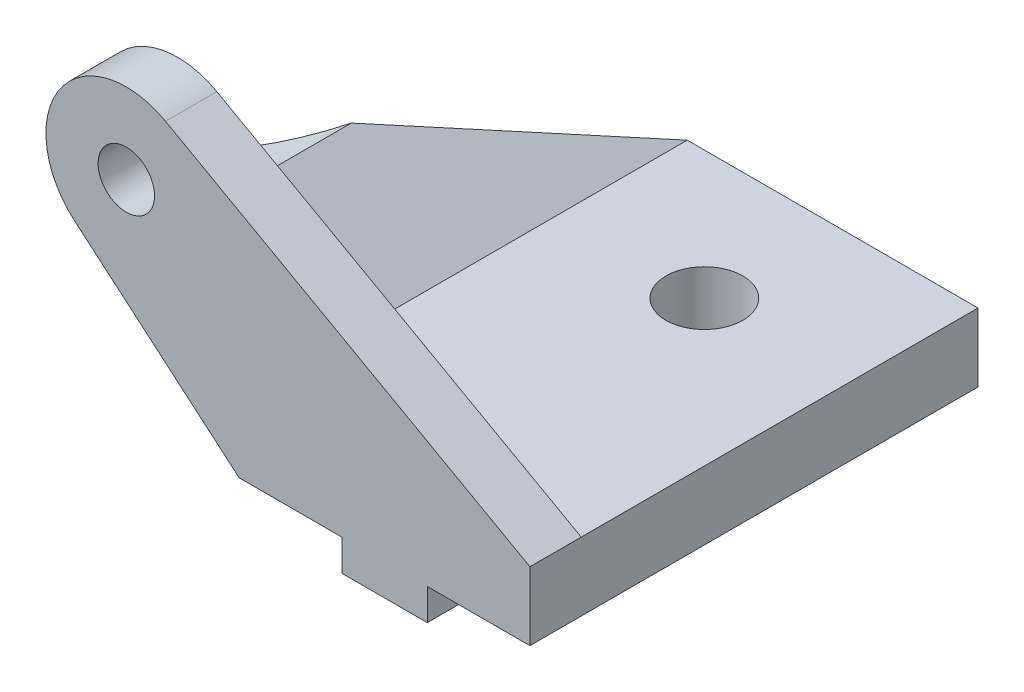
ISO-10303-21;
HEADER;
FILE_DESCRIPTION(('STEP AP214'),'2;1');
FILE_NAME('part.step','',(''),(''),'','','');
FILE_SCHEMA(('AUTOMOTIVE_DESIGN { 1 0 10303 214 1 1 1 1 }'));
ENDSEC;
DATA;
#1=APPLICATION_CONTEXT('core data for automotive mechanical design processes');
#2=APPLICATION_PROTOCOL_DEFINITION('international standard','automotive_design',2000,#1);
#3=PRODUCT_CONTEXT('',#1,'mechanical');
#4=PRODUCT('Part','Part','',(#3));
#5=PRODUCT_RELATED_PRODUCT_CATEGORY('part','',(#4));
#6=PRODUCT_DEFINITION_FORMATION('','',#4);
#7=PRODUCT_DEFINITION_CONTEXT('part definition',#1,'design');
#8=PRODUCT_DEFINITION('design','',#6,#7);
#9=PRODUCT_DEFINITION_SHAPE('','',#8);
#10=(LENGTH_UNIT() NAMED_UNIT(*) SI_UNIT(.MILLI.,.METRE.));
#11=(NAMED_UNIT(*) PLANE_ANGLE_UNIT() SI_UNIT($,.RADIAN.));
#12=(NAMED_UNIT(*) SI_UNIT($,.STERADIAN.) SOLID_ANGLE_UNIT());
#13=UNCERTAINTY_MEASURE_WITH_UNIT(LENGTH_MEASURE(1.E-05),#10,'distance_accuracy_value','');
#14=(GEOMETRIC_REPRESENTATION_CONTEXT(3) GLOBAL_UNCERTAINTY_ASSIGNED_CONTEXT((#13)) GLOBAL_UNIT_ASSIGNED_CONTEXT((#10,
#11,#12)) REPRESENTATION_CONTEXT('',''));
#15=CARTESIAN_POINT('',(0.,0.,0.));
#16=DIRECTION('',(0.,0.,1.));
#17=DIRECTION('',(1.,0.,0.));
#18=AXIS2_PLACEMENT_3D('',#15,#16,#17);
#19=CARTESIAN_POINT('',(57.4545476760808,46.6673616439568,-3.));
#20=DIRECTION('',(-0.9233322774381,0.,-0.384001960204596));
#21=DIRECTION('',(-0.384001960204596,0.,0.9233322774381));
#22=AXIS2_PLACEMENT_3D('',#19,#20,#21);
#23=PLANE('',#22);
#24=DIRECTION('',(0.364955870497366,-0.311027045111073,-0.877535976355946));
#25=VECTOR('',#24,1.);
#26=CARTESIAN_POINT('',(57.4545476760808,46.6673616439568,-3.));
#27=LINE('',#26,#25);
#28=CARTESIAN_POINT('',(57.4545476760808,46.6673616439568,-3.));
#29=VERTEX_POINT('',#28);
#30=CARTESIAN_POINT('',(57.5251306932339,46.6072085431716,-3.16971678462709));
#31=VERTEX_POINT('',#30);
#32=EDGE_CURVE('E147',#29,#31,#27,.T.);
#33=ORIENTED_EDGE('',*,*,#32,.T.);
#34=CARTESIAN_POINT('',(60.5031278182863,46.2445335879022,-10.3303074915436));
#35=DIRECTION('',(-0.9233322774381,0.,-0.384001960204596));
#36=DIRECTION('',(-0.384001960204596,0.,0.9233322774381));
#37=AXIS2_PLACEMENT_3D('',#34,#35,#36);
#38=ELLIPSE('',#37,7.81246011973899,3.);
#39=CARTESIAN_POINT('',(61.3333699476798,43.3617054614645,-12.326623749277));
#40=VERTEX_POINT('',#39);
#41=EDGE_CURVE('E131',#31,#40,#38,.F.);
#42=ORIENTED_EDGE('',*,*,#41,.T.);
#43=CARTESIAN_POINT('',(67.1031278182863,38.4445335879022,-26.2));
#44=VERTEX_POINT('',#43);
#45=EDGE_CURVE('E139',#40,#44,#27,.T.);
#46=ORIENTED_EDGE('',*,*,#45,.T.);
#47=DIRECTION('',(0.,-1.,0.));
#48=VECTOR('',#47,1.);
#49=CARTESIAN_POINT('',(67.1031278182863,38.4445335879022,-26.2));
#50=LINE('',#49,#48);
#51=CARTESIAN_POINT('',(67.1031278182863,34.4445335879022,-26.2));
#52=VERTEX_POINT('',#51);
#53=EDGE_CURVE('E186',#44,#52,#50,.T.);
#54=ORIENTED_EDGE('',*,*,#53,.T.);
#55=DIRECTION('',(0.364955870497366,-0.311027045111073,-0.877535976355946));
#56=VECTOR('',#55,1.);
#57=CARTESIAN_POINT('',(57.4545476760808,42.6673616439568,-3.));
#58=LINE('',#57,#56);
#59=CARTESIAN_POINT('',(57.4545476760808,42.6673616439568,-3.));
#60=VERTEX_POINT('',#59);
#61=EDGE_CURVE('E149',#60,#52,#58,.T.);
#62=ORIENTED_EDGE('',*,*,#61,.F.);
#63=DIRECTION('',(0.,-1.,0.));
#64=VECTOR('',#63,1.);
#65=CARTESIAN_POINT('',(57.4545476760808,46.6673616439568,-3.));
#66=LINE('',#65,#64);
#67=EDGE_CURVE('E155',#29,#60,#66,.T.);
#68=ORIENTED_EDGE('',*,*,#67,.F.);
#69=EDGE_LOOP('',(#33,#42,#46,#54,#62,#68));
#70=FACE_BOUND('',#69,.T.);
#71=ADVANCED_FACE('F35',(#70),#23,.T.);
#72=CARTESIAN_POINT('',(45.2364692085492,57.0799982115305,0.));
#73=DIRECTION('',(0.648634072809676,0.761100413605413,0.));
#74=DIRECTION('',(-0.761100413605413,0.648634072809676,0.));
#75=AXIS2_PLACEMENT_3D('',#72,#73,#74);
#76=PLANE('',#75);
#77=DIRECTION('',(-0.761100413605414,0.648634072809677,0.));
#78=VECTOR('',#77,1.);
#79=CARTESIAN_POINT('',(67.1031278182863,38.4445335879022,-3.));
#80=LINE('',#79,#78);
#81=CARTESIAN_POINT('',(57.5251306932339,46.6072085431716,-3.));
#82=VERTEX_POINT('',#81);
#83=EDGE_CURVE('E55',#82,#29,#80,.T.);
#84=ORIENTED_EDGE('',*,*,#83,.F.);
#85=DIRECTION('',(0.,0.,1.));
#86=VECTOR('',#85,1.);
#87=CARTESIAN_POINT('',(57.5251306932339,46.6072085431716,-36.));
#88=LINE('',#87,#86);
#89=EDGE_CURVE('E11',#82,#31,#88,.F.);
#90=ORIENTED_EDGE('',*,*,#89,.T.);
#91=ORIENTED_EDGE('',*,*,#32,.F.);
#92=EDGE_LOOP('',(#84,#90,#91));
#93=FACE_BOUND('',#92,.T.);
#94=ADVANCED_FACE('F307',(#93),#76,.T.);
#95=ORIENTED_EDGE('',*,*,#45,.F.);
#96=DIRECTION('',(0.,0.,1.));
#97=VECTOR('',#96,1.);
#98=CARTESIAN_POINT('',(61.3333699476798,43.3617054614645,-36.));
#99=LINE('',#98,#97);
#100=CARTESIAN_POINT('',(61.3333699476798,43.3617054614645,-3.));
#101=VERTEX_POINT('',#100);
#102=EDGE_CURVE('E43',#40,#101,#99,.T.);
#103=ORIENTED_EDGE('',*,*,#102,.T.);
#104=CARTESIAN_POINT('',(67.1031278182863,38.4445335879022,-3.));
#105=VERTEX_POINT('',#104);
#106=EDGE_CURVE('E138',#105,#101,#80,.T.);
#107=ORIENTED_EDGE('',*,*,#106,.F.);
#108=DIRECTION('',(0.,0.,1.));
#109=VECTOR('',#108,1.);
#110=CARTESIAN_POINT('',(67.1031278182863,38.4445335879022,-26.2));
#111=LINE('',#110,#109);
#112=EDGE_CURVE('E140',#44,#105,#111,.T.);
#113=ORIENTED_EDGE('',*,*,#112,.F.);
#114=EDGE_LOOP('',(#95,#103,#107,#113));
#115=FACE_BOUND('',#114,.T.);
#116=ADVANCED_FACE('F136',(#115),#76,.T.);
#117=CARTESIAN_POINT('',(67.1031278182863,38.4445335879022,-26.2));
#118=DIRECTION('',(0.,1.,0.));
#119=DIRECTION('',(0.,0.,1.));
#120=AXIS2_PLACEMENT_3D('',#117,#118,#119);
#121=PLANE('',#120);
#122=DIRECTION('',(-1.,0.,0.));
#123=VECTOR('',#122,1.);
#124=CARTESIAN_POINT('',(84.1031278182863,38.4445335879022,-3.));
#125=LINE('',#124,#123);
#126=CARTESIAN_POINT('',(84.1031278182863,38.4445335879022,-3.));
#127=VERTEX_POINT('',#126);
#128=EDGE_CURVE('E144',#127,#105,#125,.T.);
#129=ORIENTED_EDGE('',*,*,#128,.F.);
#130=DIRECTION('',(0.,0.,1.));
#131=VECTOR('',#130,1.);
#132=CARTESIAN_POINT('',(84.1031278182863,38.4445335879022,-26.2));
#133=LINE('',#132,#131);
#134=CARTESIAN_POINT('',(84.1031278182863,38.4445335879022,-26.2));
#135=VERTEX_POINT('',#134);
#136=EDGE_CURVE('E230',#135,#127,#133,.T.);
#137=ORIENTED_EDGE('',*,*,#136,.F.);
#138=DIRECTION('',(-1.,0.,0.));
#139=VECTOR('',#138,1.);
#140=CARTESIAN_POINT('',(67.1031278182863,38.4445335879022,-26.2));
#141=LINE('',#140,#139);
#142=EDGE_CURVE('E208',#135,#44,#141,.T.);
#143=ORIENTED_EDGE('',*,*,#142,.T.);
#144=ORIENTED_EDGE('',*,*,#112,.T.);
#145=EDGE_LOOP('',(#129,#137,#143,#144));
#146=FACE_BOUND('',#145,.T.);
#147=CARTESIAN_POINT('',(75.6031278182863,38.4445335879022,-18.7));
#148=DIRECTION('',(0.,1.,0.));
#149=DIRECTION('',(0.,0.,1.));
#150=AXIS2_PLACEMENT_3D('',#147,#148,#149);
#151=CIRCLE('',#150,2.25);
#152=CARTESIAN_POINT('',(75.6031278182863,38.4445335879022,-16.45));
#153=VERTEX_POINT('',#152);
#154=EDGE_CURVE('E182',#153,#153,#151,.T.);
#155=ORIENTED_EDGE('',*,*,#154,.F.);
#156=EDGE_LOOP('',(#155));
#157=FACE_BOUND('',#156,.T.);
#158=ADVANCED_FACE('F285',(#146,#157),#121,.T.);
#159=CARTESIAN_POINT('',(84.1031278182863,38.4445335879022,-26.2));
#160=DIRECTION('',(1.,0.,0.));
#161=DIRECTION('',(0.,0.,-1.));
#162=AXIS2_PLACEMENT_3D('',#159,#160,#161);
#163=PLANE('',#162);
#164=DIRECTION('',(0.,1.,0.));
#165=VECTOR('',#164,1.);
#166=CARTESIAN_POINT('',(84.1031278182863,38.4445335879022,0.));
#167=LINE('',#166,#165);
#168=CARTESIAN_POINT('',(84.1031278182863,34.4445335879022,0.));
#169=VERTEX_POINT('',#168);
#170=CARTESIAN_POINT('',(84.1031278182863,38.4445335879022,0.));
#171=VERTEX_POINT('',#170);
#172=EDGE_CURVE('E190',#169,#171,#167,.T.);
#173=ORIENTED_EDGE('',*,*,#172,.F.);
#174=DIRECTION('',(0.,0.,1.));
#175=VECTOR('',#174,1.);
#176=CARTESIAN_POINT('',(84.1031278182863,34.4445335879022,-26.2));
#177=LINE('',#176,#175);
#178=CARTESIAN_POINT('',(84.1031278182863,34.4445335879022,-26.2));
#179=VERTEX_POINT('',#178);
#180=EDGE_CURVE('E233',#179,#169,#177,.T.);
#181=ORIENTED_EDGE('',*,*,#180,.F.);
#182=DIRECTION('',(0.,1.,0.));
#183=VECTOR('',#182,1.);
#184=CARTESIAN_POINT('',(84.1031278182863,38.4445335879022,-26.2));
#185=LINE('',#184,#183);
#186=EDGE_CURVE('E205',#179,#135,#185,.T.);
#187=ORIENTED_EDGE('',*,*,#186,.T.);
#188=ORIENTED_EDGE('',*,*,#136,.T.);
#189=DIRECTION('',(0.,0.,1.));
#190=VECTOR('',#189,1.);
#191=CARTESIAN_POINT('',(84.1031278182863,38.4445335879022,-3.));
#192=LINE('',#191,#190);
#193=EDGE_CURVE('E176',#127,#171,#192,.T.);
#194=ORIENTED_EDGE('',*,*,#193,.T.);
#195=EDGE_LOOP('',(#173,#181,#187,#188,#194));
#196=FACE_BOUND('',#195,.T.);
#197=ADVANCED_FACE('F289',(#196),#163,.T.);
#198=CARTESIAN_POINT('',(78.1031278182863,34.4445335879022,-26.2));
#199=DIRECTION('',(0.,-1.,0.));
#200=DIRECTION('',(0.,0.,-1.));
#201=AXIS2_PLACEMENT_3D('',#198,#199,#200);
#202=PLANE('',#201);
#203=DIRECTION('',(1.,0.,0.));
#204=VECTOR('',#203,1.);
#205=CARTESIAN_POINT('',(78.1031278182863,34.4445335879022,0.));
#206=LINE('',#205,#204);
#207=CARTESIAN_POINT('',(78.1031278182863,34.4445335879022,0.));
#208=VERTEX_POINT('',#207);
#209=EDGE_CURVE('E224',#208,#169,#206,.T.);
#210=ORIENTED_EDGE('',*,*,#209,.F.);
#211=DIRECTION('',(0.,0.,1.));
#212=VECTOR('',#211,1.);
#213=CARTESIAN_POINT('',(78.1031278182863,34.4445335879022,-26.2));
#214=LINE('',#213,#212);
#215=CARTESIAN_POINT('',(78.1031278182863,34.4445335879022,-26.2));
#216=VERTEX_POINT('',#215);
#217=EDGE_CURVE('E235',#216,#208,#214,.T.);
#218=ORIENTED_EDGE('',*,*,#217,.F.);
#219=DIRECTION('',(1.,0.,0.));
#220=VECTOR('',#219,1.);
#221=CARTESIAN_POINT('',(78.1031278182863,34.4445335879022,-26.2));
#222=LINE('',#221,#220);
#223=EDGE_CURVE('E202',#216,#179,#222,.T.);
#224=ORIENTED_EDGE('',*,*,#223,.T.);
#225=ORIENTED_EDGE('',*,*,#180,.T.);
#226=EDGE_LOOP('',(#210,#218,#224,#225));
#227=FACE_BOUND('',#226,.T.);
#228=ADVANCED_FACE('F293',(#227),#202,.T.);
#229=CARTESIAN_POINT('',(78.1031278182863,32.6111335879022,-26.2));
#230=DIRECTION('',(1.,0.,0.));
#231=DIRECTION('',(0.,0.,-1.));
#232=AXIS2_PLACEMENT_3D('',#229,#230,#231);
#233=PLANE('',#232);
#234=DIRECTION('',(0.,1.,0.));
#235=VECTOR('',#234,1.);
#236=CARTESIAN_POINT('',(78.1031278182863,32.6111335879022,0.));
#237=LINE('',#236,#235);
#238=CARTESIAN_POINT('',(78.1031278182863,32.6111335879022,0.));
#239=VERTEX_POINT('',#238);
#240=EDGE_CURVE('E221',#239,#208,#237,.T.);
#241=ORIENTED_EDGE('',*,*,#240,.F.);
#242=DIRECTION('',(0.,0.,1.));
#243=VECTOR('',#242,1.);
#244=CARTESIAN_POINT('',(78.1031278182863,32.6111335879022,-26.2));
#245=LINE('',#244,#243);
#246=CARTESIAN_POINT('',(78.1031278182863,32.6111335879022,-26.2));
#247=VERTEX_POINT('',#246);
#248=EDGE_CURVE('E237',#247,#239,#245,.T.);
#249=ORIENTED_EDGE('',*,*,#248,.F.);
#250=DIRECTION('',(0.,1.,0.));
#251=VECTOR('',#250,1.);
#252=CARTESIAN_POINT('',(78.1031278182863,32.6111335879022,-26.2));
#253=LINE('',#252,#251);
#254=EDGE_CURVE('E199',#247,#216,#253,.T.);
#255=ORIENTED_EDGE('',*,*,#254,.T.);
#256=ORIENTED_EDGE('',*,*,#217,.T.);
#257=EDGE_LOOP('',(#241,#249,#255,#256));
#258=FACE_BOUND('',#257,.T.);
#259=ADVANCED_FACE('F254',(#258),#233,.T.);
#260=CARTESIAN_POINT('',(73.1031278182863,32.6111335879022,-26.2));
#261=DIRECTION('',(0.,-1.,0.));
#262=DIRECTION('',(0.,0.,-1.));
#263=AXIS2_PLACEMENT_3D('',#260,#261,#262);
#264=PLANE('',#263);
#265=CARTESIAN_POINT('',(75.6031278182863,32.6111335879022,-18.7));
#266=DIRECTION('',(0.,-1.,0.));
#267=DIRECTION('',(0.,0.,-1.));
#268=AXIS2_PLACEMENT_3D('',#265,#266,#267);
#269=CIRCLE('',#268,2.25);
#270=CARTESIAN_POINT('',(75.6031278182863,32.6111335879022,-16.45));
#271=VERTEX_POINT('',#270);
#272=EDGE_CURVE('E185',#271,#271,#269,.T.);
#273=ORIENTED_EDGE('',*,*,#272,.F.);
#274=EDGE_LOOP('',(#273));
#275=FACE_BOUND('',#274,.T.);
#276=DIRECTION('',(1.,0.,0.));
#277=VECTOR('',#276,1.);
#278=CARTESIAN_POINT('',(73.1031278182863,32.6111335879022,0.));
#279=LINE('',#278,#277);
#280=CARTESIAN_POINT('',(73.1031278182863,32.6111335879022,0.));
#281=VERTEX_POINT('',#280);
#282=EDGE_CURVE('E218',#281,#239,#279,.T.);
#283=ORIENTED_EDGE('',*,*,#282,.F.);
#284=DIRECTION('',(0.,0.,1.));
#285=VECTOR('',#284,1.);
#286=CARTESIAN_POINT('',(73.1031278182863,32.6111335879022,-26.2));
#287=LINE('',#286,#285);
#288=CARTESIAN_POINT('',(73.1031278182863,32.6111335879022,-26.2));
#289=VERTEX_POINT('',#288);
#290=EDGE_CURVE('E239',#289,#281,#287,.T.);
#291=ORIENTED_EDGE('',*,*,#290,.F.);
#292=DIRECTION('',(1.,0.,0.));
#293=VECTOR('',#292,1.);
#294=CARTESIAN_POINT('',(73.1031278182863,32.6111335879022,-26.2));
#295=LINE('',#294,#293);
#296=EDGE_CURVE('E196',#289,#247,#295,.T.);
#297=ORIENTED_EDGE('',*,*,#296,.T.);
#298=ORIENTED_EDGE('',*,*,#248,.T.);
#299=EDGE_LOOP('',(#283,#291,#297,#298));
#300=FACE_BOUND('',#299,.T.);
#301=ADVANCED_FACE('F250',(#275,#300),#264,.T.);
#302=CARTESIAN_POINT('',(73.1031278182863,32.6111335879022,-26.2));
#303=DIRECTION('',(-1.,0.,0.));
#304=DIRECTION('',(0.,0.,1.));
#305=AXIS2_PLACEMENT_3D('',#302,#303,#304);
#306=PLANE('',#305);
#307=DIRECTION('',(0.,-1.,0.));
#308=VECTOR('',#307,1.);
#309=CARTESIAN_POINT('',(73.1031278182863,32.6111335879022,0.));
#310=LINE('',#309,#308);
#311=CARTESIAN_POINT('',(73.1031278182863,34.4445335879022,0.));
#312=VERTEX_POINT('',#311);
#313=EDGE_CURVE('E215',#312,#281,#310,.T.);
#314=ORIENTED_EDGE('',*,*,#313,.F.);
#315=DIRECTION('',(0.,0.,1.));
#316=VECTOR('',#315,1.);
#317=CARTESIAN_POINT('',(73.1031278182863,34.4445335879022,-26.2));
#318=LINE('',#317,#316);
#319=CARTESIAN_POINT('',(73.1031278182863,34.4445335879022,-26.2));
#320=VERTEX_POINT('',#319);
#321=EDGE_CURVE('E241',#320,#312,#318,.T.);
#322=ORIENTED_EDGE('',*,*,#321,.F.);
#323=DIRECTION('',(0.,-1.,0.));
#324=VECTOR('',#323,1.);
#325=CARTESIAN_POINT('',(73.1031278182863,32.6111335879022,-26.2));
#326=LINE('',#325,#324);
#327=EDGE_CURVE('E193',#320,#289,#326,.T.);
#328=ORIENTED_EDGE('',*,*,#327,.T.);
#329=ORIENTED_EDGE('',*,*,#290,.T.);
#330=EDGE_LOOP('',(#314,#322,#328,#329));
#331=FACE_BOUND('',#330,.T.);
#332=ADVANCED_FACE('F253',(#331),#306,.T.);
#333=CARTESIAN_POINT('',(67.1031278182863,34.4445335879022,-26.2));
#334=DIRECTION('',(0.,-1.,0.));
#335=DIRECTION('',(0.,0.,-1.));
#336=AXIS2_PLACEMENT_3D('',#333,#334,#335);
#337=PLANE('',#336);
#338=DIRECTION('',(1.,0.,0.));
#339=VECTOR('',#338,1.);
#340=CARTESIAN_POINT('',(67.1031278182863,34.4445335879022,0.));
#341=LINE('',#340,#339);
#342=CARTESIAN_POINT('',(67.1031278182863,34.4445335879022,0.));
#343=VERTEX_POINT('',#342);
#344=EDGE_CURVE('E212',#343,#312,#341,.T.);
#345=ORIENTED_EDGE('',*,*,#344,.F.);
#346=DIRECTION('',(0.,0.,1.));
#347=VECTOR('',#346,1.);
#348=CARTESIAN_POINT('',(67.1031278182863,34.4445335879022,-26.2));
#349=LINE('',#348,#347);
#350=EDGE_CURVE('E211',#52,#343,#349,.T.);
#351=ORIENTED_EDGE('',*,*,#350,.F.);
#352=DIRECTION('',(1.,0.,0.));
#353=VECTOR('',#352,1.);
#354=CARTESIAN_POINT('',(67.1031278182863,34.4445335879022,-26.2));
#355=LINE('',#354,#353);
#356=EDGE_CURVE('E189',#52,#320,#355,.T.);
#357=ORIENTED_EDGE('',*,*,#356,.T.);
#358=ORIENTED_EDGE('',*,*,#321,.T.);
#359=EDGE_LOOP('',(#345,#351,#357,#358));
#360=FACE_BOUND('',#359,.T.);
#361=ADVANCED_FACE('F37',(#360),#337,.T.);
#362=CARTESIAN_POINT('',(0.,0.,-26.2));
#363=DIRECTION('',(0.,0.,1.));
#364=DIRECTION('',(1.,0.,0.));
#365=AXIS2_PLACEMENT_3D('',#362,#363,#364);
#366=PLANE('',#365);
#367=ORIENTED_EDGE('',*,*,#53,.F.);
#368=ORIENTED_EDGE('',*,*,#142,.F.);
#369=ORIENTED_EDGE('',*,*,#186,.F.);
#370=ORIENTED_EDGE('',*,*,#223,.F.);
#371=ORIENTED_EDGE('',*,*,#254,.F.);
#372=ORIENTED_EDGE('',*,*,#296,.F.);
#373=ORIENTED_EDGE('',*,*,#327,.F.);
#374=ORIENTED_EDGE('',*,*,#356,.F.);
#375=EDGE_LOOP('',(#367,#368,#369,#370,#371,#372,#373,#374));
#376=FACE_BOUND('',#375,.T.);
#377=ADVANCED_FACE('F269',(#376),#366,.F.);
#378=CARTESIAN_POINT('',(0.,0.,0.));
#379=DIRECTION('',(0.,0.,1.));
#380=DIRECTION('',(1.,0.,0.));
#381=AXIS2_PLACEMENT_3D('',#378,#379,#380);
#382=PLANE('',#381);
#383=CARTESIAN_POINT('',(60.5031278182863,46.2445335879022,0.));
#384=DIRECTION('',(0.,0.,-1.));
#385=DIRECTION('',(-1.,0.,0.));
#386=AXIS2_PLACEMENT_3D('',#383,#384,#385);
#387=CIRCLE('',#386,1.65);
#388=CARTESIAN_POINT('',(58.8531278182863,46.2445335879022,0.));
#389=VERTEX_POINT('',#388);
#390=EDGE_CURVE('E158',#389,#389,#387,.T.);
#391=ORIENTED_EDGE('',*,*,#390,.T.);
#392=EDGE_LOOP('',(#391));
#393=FACE_BOUND('',#392,.T.);
#394=ORIENTED_EDGE('',*,*,#172,.T.);
#395=DIRECTION('',(0.873015923318111,-0.487691703469545,0.));
#396=VECTOR('',#395,1.);
#397=CARTESIAN_POINT('',(62.7952788245932,50.3477084274973,0.));
#398=LINE('',#397,#396);
#399=CARTESIAN_POINT('',(62.7952788245932,50.3477084274973,0.));
#400=VERTEX_POINT('',#399);
#401=EDGE_CURVE('E171',#400,#171,#398,.T.);
#402=ORIENTED_EDGE('',*,*,#401,.F.);
#403=CARTESIAN_POINT('',(60.5031278182863,46.2445335879022,0.));
#404=DIRECTION('',(0.,0.,-1.));
#405=DIRECTION('',(-1.,0.,0.));
#406=AXIS2_PLACEMENT_3D('',#403,#404,#405);
#407=CIRCLE('',#406,4.7);
#408=CARTESIAN_POINT('',(57.4545476760808,42.6673616439568,0.));
#409=VERTEX_POINT('',#408);
#410=EDGE_CURVE('E160',#409,#400,#407,.T.);
#411=ORIENTED_EDGE('',*,*,#410,.F.);
#412=DIRECTION('',(-0.761100413605414,0.648634072809677,0.));
#413=VECTOR('',#412,1.);
#414=CARTESIAN_POINT('',(67.1031278182863,34.4445335879022,0.));
#415=LINE('',#414,#413);
#416=EDGE_CURVE('E165',#343,#409,#415,.T.);
#417=ORIENTED_EDGE('',*,*,#416,.F.);
#418=ORIENTED_EDGE('',*,*,#344,.T.);
#419=ORIENTED_EDGE('',*,*,#313,.T.);
#420=ORIENTED_EDGE('',*,*,#282,.T.);
#421=ORIENTED_EDGE('',*,*,#240,.T.);
#422=ORIENTED_EDGE('',*,*,#209,.T.);
#423=EDGE_LOOP('',(#394,#402,#411,#417,#418,#419,#420,#421,#422));
#424=FACE_BOUND('',#423,.T.);
#425=ADVANCED_FACE('F261',(#393,#424),#382,.T.);
#426=CARTESIAN_POINT('',(75.6031278182863,12.2445335879022,-18.7));
#427=DIRECTION('',(0.,1.,0.));
#428=DIRECTION('',(0.,0.,1.));
#429=AXIS2_PLACEMENT_3D('',#426,#427,#428);
#430=CYLINDRICAL_SURFACE('',#429,2.25);
#431=CARTESIAN_POINT('',(75.6031278182863,32.6111335879022,-16.45));
#432=CARTESIAN_POINT('',(75.6031278182863,32.6718981712355,-16.45));
#433=CARTESIAN_POINT('',(75.6031278182863,32.7326627545689,-16.45));
#434=CARTESIAN_POINT('',(75.6031278182863,32.8541919212355,-16.45));
#435=CARTESIAN_POINT('',(75.6031278182863,32.9149565045689,-16.45));
#436=CARTESIAN_POINT('',(75.6031278182863,33.0364856712355,-16.45));
#437=CARTESIAN_POINT('',(75.6031278182863,33.0972502545689,-16.45));
#438=CARTESIAN_POINT('',(75.6031278182863,33.2187794212355,-16.45));
#439=CARTESIAN_POINT('',(75.6031278182863,33.2795440045689,-16.45));
#440=CARTESIAN_POINT('',(75.6031278182863,33.4010731712355,-16.45));
#441=CARTESIAN_POINT('',(75.6031278182863,33.4618377545689,-16.45));
#442=CARTESIAN_POINT('',(75.6031278182863,33.5833669212355,-16.45));
#443=CARTESIAN_POINT('',(75.6031278182863,33.6441315045689,-16.45));
#444=CARTESIAN_POINT('',(75.6031278182863,33.7656606712355,-16.45));
#445=CARTESIAN_POINT('',(75.6031278182863,33.8264252545689,-16.45));
#446=CARTESIAN_POINT('',(75.6031278182863,33.9479544212355,-16.45));
#447=CARTESIAN_POINT('',(75.6031278182863,34.0087190045689,-16.45));
#448=CARTESIAN_POINT('',(75.6031278182863,34.1302481712355,-16.45));
#449=CARTESIAN_POINT('',(75.6031278182863,34.1910127545689,-16.45));
#450=CARTESIAN_POINT('',(75.6031278182863,34.3125419212355,-16.45));
#451=CARTESIAN_POINT('',(75.6031278182863,34.3733065045689,-16.45));
#452=CARTESIAN_POINT('',(75.6031278182863,34.4948356712355,-16.45));
#453=CARTESIAN_POINT('',(75.6031278182863,34.5556002545689,-16.45));
#454=CARTESIAN_POINT('',(75.6031278182863,34.6771294212355,-16.45));
#455=CARTESIAN_POINT('',(75.6031278182863,34.7378940045689,-16.45));
#456=CARTESIAN_POINT('',(75.6031278182863,34.8594231712355,-16.45));
#457=CARTESIAN_POINT('',(75.6031278182863,34.9201877545689,-16.45));
#458=CARTESIAN_POINT('',(75.6031278182863,35.0417169212355,-16.45));
#459=CARTESIAN_POINT('',(75.6031278182863,35.1024815045689,-16.45));
#460=CARTESIAN_POINT('',(75.6031278182863,35.2240106712355,-16.45));
#461=CARTESIAN_POINT('',(75.6031278182863,35.2847752545689,-16.45));
#462=CARTESIAN_POINT('',(75.6031278182863,35.4063044212355,-16.45));
#463=CARTESIAN_POINT('',(75.6031278182863,35.4670690045689,-16.45));
#464=CARTESIAN_POINT('',(75.6031278182863,35.5885981712355,-16.45));
#465=CARTESIAN_POINT('',(75.6031278182863,35.6493627545689,-16.45));
#466=CARTESIAN_POINT('',(75.6031278182863,35.7708919212355,-16.45));
#467=CARTESIAN_POINT('',(75.6031278182863,35.8316565045689,-16.45));
#468=CARTESIAN_POINT('',(75.6031278182863,35.9531856712355,-16.45));
#469=CARTESIAN_POINT('',(75.6031278182863,36.0139502545689,-16.45));
#470=CARTESIAN_POINT('',(75.6031278182863,36.1354794212355,-16.45));
#471=CARTESIAN_POINT('',(75.6031278182863,36.1962440045689,-16.45));
#472=CARTESIAN_POINT('',(75.6031278182863,36.3177731712355,-16.45));
#473=CARTESIAN_POINT('',(75.6031278182863,36.3785377545689,-16.45));
#474=CARTESIAN_POINT('',(75.6031278182863,36.5000669212355,-16.45));
#475=CARTESIAN_POINT('',(75.6031278182863,36.5608315045689,-16.45));
#476=CARTESIAN_POINT('',(75.6031278182863,36.6823606712355,-16.45));
#477=CARTESIAN_POINT('',(75.6031278182863,36.7431252545689,-16.45));
#478=CARTESIAN_POINT('',(75.6031278182863,36.8646544212355,-16.45));
#479=CARTESIAN_POINT('',(75.6031278182863,36.9254190045689,-16.45));
#480=CARTESIAN_POINT('',(75.6031278182863,37.0469481712355,-16.45));
#481=CARTESIAN_POINT('',(75.6031278182863,37.1077127545689,-16.45));
#482=CARTESIAN_POINT('',(75.6031278182863,37.2292419212355,-16.45));
#483=CARTESIAN_POINT('',(75.6031278182863,37.2900065045689,-16.45));
#484=CARTESIAN_POINT('',(75.6031278182863,37.4115356712355,-16.45));
#485=CARTESIAN_POINT('',(75.6031278182863,37.4723002545689,-16.45));
#486=CARTESIAN_POINT('',(75.6031278182863,37.5938294212355,-16.45));
#487=CARTESIAN_POINT('',(75.6031278182863,37.6545940045689,-16.45));
#488=CARTESIAN_POINT('',(75.6031278182863,37.7761231712355,-16.45));
#489=CARTESIAN_POINT('',(75.6031278182863,37.8368877545689,-16.45));
#490=CARTESIAN_POINT('',(75.6031278182863,37.9584169212355,-16.45));
#491=CARTESIAN_POINT('',(75.6031278182863,38.0191815045689,-16.45));
#492=CARTESIAN_POINT('',(75.6031278182863,38.1407106712355,-16.45));
#493=CARTESIAN_POINT('',(75.6031278182863,38.2014752545689,-16.45));
#494=CARTESIAN_POINT('',(75.6031278182863,38.3230044212355,-16.45));
#495=CARTESIAN_POINT('',(75.6031278182863,38.3837690045689,-16.45));
#496=CARTESIAN_POINT('',(75.6031278182863,38.4445335879022,-16.45));
#497=B_SPLINE_CURVE_WITH_KNOTS('',3,(#431,#432,#433,#434,#435,#436,#437,#438,#439,#440,#441,
#442,#443,#444,#445,#446,#447,#448,#449,#450,#451,#452,#453,#454,#455,#456,#457,#458,#459,#460,
#461,#462,#463,#464,#465,#466,#467,#468,#469,#470,#471,#472,#473,#474,#475,#476,#477,#478,#479,
#480,#481,#482,#483,#484,#485,#486,#487,#488,#489,#490,#491,#492,#493,#494,#495,#496),
.UNSPECIFIED.,.F.,.F.,(4,2,2,2,2,2,2,2,2,2,2,2,2,2,2,2,2,2,2,2,2,2,2,2,2,2,2,2,2,2,2,2,4),(0.,
0.182293750000007,0.364587499999999,0.546881250000006,0.729175000000005,0.911468750000005,
1.0937625,1.27605625,1.45835000000001,1.64064375,1.82293750000001,2.00523125,2.18752500000001,
2.36981875,2.55211250000001,2.73440625000001,2.91670000000001,3.09899375000001,3.28128750000001,
3.46358125000001,3.64587500000001,3.82816875000001,4.01046250000001,4.19275625000001,
4.37505000000001,4.55734375000001,4.73963750000001,4.92193125000001,5.10422500000001,
5.28651875000001,5.46881250000002,5.65110625000001,5.83340000000002),.UNSPECIFIED.);
#498=EDGE_CURVE('BSEAM247',#271,#153,#497,.T.);
#499=ORIENTED_EDGE('',*,*,#272,.T.);
#500=ORIENTED_EDGE('',*,*,#154,.T.);
#501=ORIENTED_EDGE('',*,*,#498,.T.);
#502=ORIENTED_EDGE('',*,*,#498,.F.);
#503=EDGE_LOOP('',(#499,#501,#500,#502));
#504=FACE_BOUND('',#503,.T.);
#505=ADVANCED_FACE('F247',(#504),#430,.F.);
#506=CARTESIAN_POINT('',(60.5031278182863,46.2445335879022,-3.));
#507=DIRECTION('',(0.,0.,1.));
#508=DIRECTION('',(1.,0.,0.));
#509=AXIS2_PLACEMENT_3D('',#506,#507,#508);
#510=CYLINDRICAL_SURFACE('',#509,4.7);
#511=ORIENTED_EDGE('',*,*,#410,.T.);
#512=DIRECTION('',(0.,0.,1.));
#513=VECTOR('',#512,1.);
#514=CARTESIAN_POINT('',(62.7952788245932,50.3477084274973,-3.));
#515=LINE('',#514,#513);
#516=CARTESIAN_POINT('',(62.7952788245932,50.3477084274973,-3.));
#517=VERTEX_POINT('',#516);
#518=EDGE_CURVE('E179',#517,#400,#515,.T.);
#519=ORIENTED_EDGE('',*,*,#518,.F.);
#520=CARTESIAN_POINT('',(60.5031278182863,46.2445335879022,-3.));
#521=DIRECTION('',(0.,0.,-1.));
#522=DIRECTION('',(-1.,0.,0.));
#523=AXIS2_PLACEMENT_3D('',#520,#521,#522);
#524=CIRCLE('',#523,4.7);
#525=EDGE_CURVE('E161',#60,#517,#524,.T.);
#526=ORIENTED_EDGE('',*,*,#525,.F.);
#527=DIRECTION('',(0.,0.,1.));
#528=VECTOR('',#527,1.);
#529=CARTESIAN_POINT('',(57.4545476760808,42.6673616439568,-3.));
#530=LINE('',#529,#528);
#531=EDGE_CURVE('E168',#60,#409,#530,.T.);
#532=ORIENTED_EDGE('',*,*,#531,.T.);
#533=EDGE_LOOP('',(#511,#519,#526,#532));
#534=FACE_BOUND('',#533,.T.);
#535=ADVANCED_FACE('F279',(#534),#510,.T.);
#536=CARTESIAN_POINT('',(62.7952788245932,50.3477084274973,-3.));
#537=DIRECTION('',(-0.487691703469545,-0.873015923318111,0.));
#538=DIRECTION('',(0.873015923318111,-0.487691703469545,0.));
#539=AXIS2_PLACEMENT_3D('',#536,#537,#538);
#540=PLANE('',#539);
#541=ORIENTED_EDGE('',*,*,#401,.T.);
#542=ORIENTED_EDGE('',*,*,#193,.F.);
#543=DIRECTION('',(0.873015923318111,-0.487691703469545,0.));
#544=VECTOR('',#543,1.);
#545=CARTESIAN_POINT('',(62.7952788245932,50.3477084274973,-3.));
#546=LINE('',#545,#544);
#547=EDGE_CURVE('E164',#517,#127,#546,.T.);
#548=ORIENTED_EDGE('',*,*,#547,.F.);
#549=ORIENTED_EDGE('',*,*,#518,.T.);
#550=EDGE_LOOP('',(#541,#542,#548,#549));
#551=FACE_BOUND('',#550,.T.);
#552=ADVANCED_FACE('F297',(#551),#540,.F.);
#553=CARTESIAN_POINT('',(67.1031278182863,34.4445335879022,-3.));
#554=DIRECTION('',(0.648634072809676,0.761100413605413,0.));
#555=DIRECTION('',(-0.761100413605413,0.648634072809676,0.));
#556=AXIS2_PLACEMENT_3D('',#553,#554,#555);
#557=PLANE('',#556);
#558=ORIENTED_EDGE('',*,*,#416,.T.);
#559=ORIENTED_EDGE('',*,*,#531,.F.);
#560=ORIENTED_EDGE('',*,*,#61,.T.);
#561=ORIENTED_EDGE('',*,*,#350,.T.);
#562=EDGE_LOOP('',(#558,#559,#560,#561));
#563=FACE_BOUND('',#562,.T.);
#564=ADVANCED_FACE('F273',(#563),#557,.F.);
#565=CARTESIAN_POINT('',(60.5031278182863,46.2445335879022,-3.));
#566=DIRECTION('',(0.,0.,-1.));
#567=DIRECTION('',(-1.,0.,0.));
#568=AXIS2_PLACEMENT_3D('',#565,#566,#567);
#569=PLANE('',#568);
#570=CARTESIAN_POINT('',(60.5031278182863,46.2445335879022,-3.));
#571=DIRECTION('',(0.,0.,-1.));
#572=DIRECTION('',(-1.,0.,0.));
#573=AXIS2_PLACEMENT_3D('',#570,#571,#572);
#574=CIRCLE('',#573,3.);
#575=EDGE_CURVE('E50',#101,#82,#574,.T.);
#576=ORIENTED_EDGE('',*,*,#575,.T.);
#577=ORIENTED_EDGE('',*,*,#83,.T.);
#578=ORIENTED_EDGE('',*,*,#67,.T.);
#579=ORIENTED_EDGE('',*,*,#525,.T.);
#580=ORIENTED_EDGE('',*,*,#547,.T.);
#581=ORIENTED_EDGE('',*,*,#128,.T.);
#582=ORIENTED_EDGE('',*,*,#106,.T.);
#583=EDGE_LOOP('',(#576,#577,#578,#579,#580,#581,#582));
#584=FACE_BOUND('',#583,.T.);
#585=CARTESIAN_POINT('',(60.5031278182863,46.2445335879022,-3.));
#586=DIRECTION('',(0.,0.,-1.));
#587=DIRECTION('',(-1.,0.,0.));
#588=AXIS2_PLACEMENT_3D('',#585,#586,#587);
#589=CIRCLE('',#588,1.65);
#590=CARTESIAN_POINT('',(58.8531278182863,46.2445335879022,-3.));
#591=VERTEX_POINT('',#590);
#592=EDGE_CURVE('E151',#591,#591,#589,.T.);
#593=ORIENTED_EDGE('',*,*,#592,.F.);
#594=EDGE_LOOP('',(#593));
#595=FACE_BOUND('',#594,.T.);
#596=ADVANCED_FACE('F141',(#584,#595),#569,.T.);
#597=CARTESIAN_POINT('',(60.5031278182863,46.2445335879022,0.));
#598=DIRECTION('',(0.,0.,-1.));
#599=DIRECTION('',(-1.,0.,0.));
#600=AXIS2_PLACEMENT_3D('',#597,#598,#599);
#601=CYLINDRICAL_SURFACE('',#600,1.65);
#602=ORIENTED_EDGE('',*,*,#390,.F.);
#603=EDGE_LOOP('',(#602));
#604=FACE_BOUND('',#603,.T.);
#605=ORIENTED_EDGE('',*,*,#592,.T.);
#606=EDGE_LOOP('',(#605));
#607=FACE_BOUND('',#606,.T.);
#608=ADVANCED_FACE('F317',(#604,#607),#601,.F.);
#609=CARTESIAN_POINT('',(60.5031278182863,46.2445335879022,-36.));
#610=DIRECTION('',(0.,0.,1.));
#611=DIRECTION('',(1.,0.,0.));
#612=AXIS2_PLACEMENT_3D('',#609,#610,#611);
#613=CYLINDRICAL_SURFACE('',#612,3.);
#614=ORIENTED_EDGE('',*,*,#575,.F.);
#615=ORIENTED_EDGE('',*,*,#102,.F.);
#616=ORIENTED_EDGE('',*,*,#41,.F.);
#617=ORIENTED_EDGE('',*,*,#89,.F.);
#618=EDGE_LOOP('',(#614,#615,#616,#617));
#619=FACE_BOUND('',#618,.T.);
#620=ADVANCED_FACE('F129',(#619),#613,.F.);
#621=CLOSED_SHELL('',(#71,#94,#116,#158,#197,#228,#259,#301,#332,#361,#377,#425,#505,#535,#552,
#564,#596,#608,#620));
#622=MANIFOLD_SOLID_BREP('B2',#621);
#623=ADVANCED_BREP_SHAPE_REPRESENTATION('',(#18,#622),#14);
#624=SHAPE_DEFINITION_REPRESENTATION(#9,#623);
ENDSEC;
END-ISO-10303-21;
